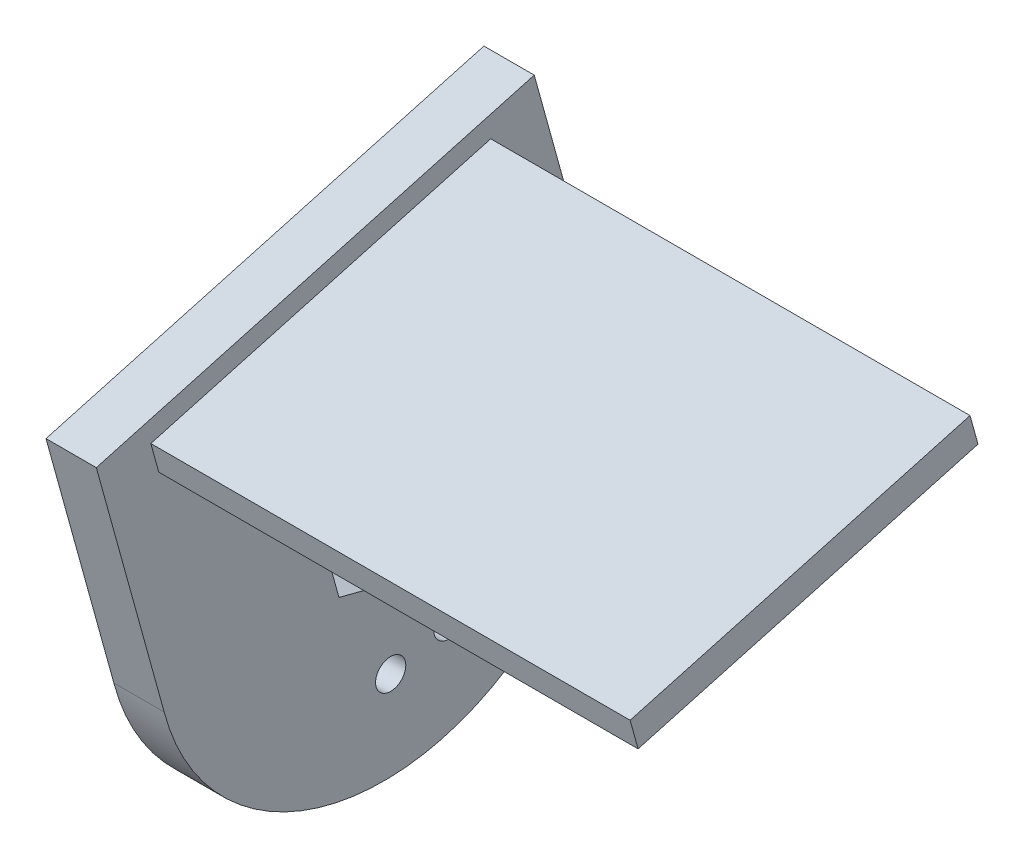
ISO-10303-21;
HEADER;
FILE_DESCRIPTION(('STEP AP214'),'2;1');
FILE_NAME('part.step','',(''),(''),'','','');
FILE_SCHEMA(('AUTOMOTIVE_DESIGN { 1 0 10303 214 1 1 1 1 }'));
ENDSEC;
DATA;
#1=APPLICATION_CONTEXT('core data for automotive mechanical design processes');
#2=APPLICATION_PROTOCOL_DEFINITION('international standard','automotive_design',2000,#1);
#3=PRODUCT_CONTEXT('',#1,'mechanical');
#4=PRODUCT('Part','Part','',(#3));
#5=PRODUCT_RELATED_PRODUCT_CATEGORY('part','',(#4));
#6=PRODUCT_DEFINITION_FORMATION('','',#4);
#7=PRODUCT_DEFINITION_CONTEXT('part definition',#1,'design');
#8=PRODUCT_DEFINITION('design','',#6,#7);
#9=PRODUCT_DEFINITION_SHAPE('','',#8);
#10=(LENGTH_UNIT() NAMED_UNIT(*) SI_UNIT(.MILLI.,.METRE.));
#11=(NAMED_UNIT(*) PLANE_ANGLE_UNIT() SI_UNIT($,.RADIAN.));
#12=(NAMED_UNIT(*) SI_UNIT($,.STERADIAN.) SOLID_ANGLE_UNIT());
#13=UNCERTAINTY_MEASURE_WITH_UNIT(LENGTH_MEASURE(1.E-05),#10,'distance_accuracy_value','');
#14=(GEOMETRIC_REPRESENTATION_CONTEXT(3) GLOBAL_UNCERTAINTY_ASSIGNED_CONTEXT((#13)) GLOBAL_UNIT_ASSIGNED_CONTEXT((#10,
#11,#12)) REPRESENTATION_CONTEXT('',''));
#15=CARTESIAN_POINT('',(0.,0.,0.));
#16=DIRECTION('',(0.,0.,1.));
#17=DIRECTION('',(1.,0.,0.));
#18=AXIS2_PLACEMENT_3D('',#15,#16,#17);
#19=CARTESIAN_POINT('',(5.,0.,0.));
#20=DIRECTION('',(1.,0.,0.));
#21=DIRECTION('',(0.,0.,-1.));
#22=AXIS2_PLACEMENT_3D('',#19,#20,#21);
#23=PLANE('',#22);
#24=CARTESIAN_POINT('',(5.,-13.6872135362353,-0.669304584604845));
#25=DIRECTION('',(1.,0.,0.));
#26=DIRECTION('',(0.,0.,-1.));
#27=AXIS2_PLACEMENT_3D('',#24,#25,#26);
#28=CIRCLE('',#27,1.5);
#29=CARTESIAN_POINT('',(5.,-13.6872135362353,-2.16930458460485));
#30=VERTEX_POINT('',#29);
#31=EDGE_CURVE('E179',#30,#30,#28,.T.);
#32=ORIENTED_EDGE('',*,*,#31,.F.);
#33=EDGE_LOOP('',(#32));
#34=FACE_BOUND('',#33,.T.);
#35=CARTESIAN_POINT('',(5.,-12.0893135533867,-6.45261813695633));
#36=DIRECTION('',(1.,0.,0.));
#37=DIRECTION('',(0.,0.,-1.));
#38=AXIS2_PLACEMENT_3D('',#35,#36,#37);
#39=CIRCLE('',#38,1.5);
#40=CARTESIAN_POINT('',(5.,-12.0893135533867,-7.95261813695633));
#41=VERTEX_POINT('',#40);
#42=EDGE_CURVE('E185',#41,#41,#39,.T.);
#43=ORIENTED_EDGE('',*,*,#42,.F.);
#44=EDGE_LOOP('',(#43));
#45=FACE_BOUND('',#44,.T.);
#46=DIRECTION('',(0.,0.25130579972035,0.967907740968588));
#47=VECTOR('',#46,1.);
#48=CARTESIAN_POINT('',(5.,-6.14217687946013,-1.69705208640331));
#49=LINE('',#48,#47);
#50=CARTESIAN_POINT('',(5.,-6.14217687946013,-1.69705208640331));
#51=VERTEX_POINT('',#50);
#52=CARTESIAN_POINT('',(5.,-4.54077865810072,4.47075516894825));
#53=VERTEX_POINT('',#52);
#54=EDGE_CURVE('E189',#51,#53,#49,.T.);
#55=ORIENTED_EDGE('',*,*,#54,.T.);
#56=DIRECTION('',(0.,0.96388559205858,0.266316663808106));
#57=VECTOR('',#56,1.);
#58=CARTESIAN_POINT('',(5.,-4.54077865810072,4.47075516894825));
#59=LINE('',#58,#57);
#60=CARTESIAN_POINT('',(5.,1.60139822135941,6.16780725535156));
#61=VERTEX_POINT('',#60);
#62=EDGE_CURVE('E192',#53,#61,#59,.T.);
#63=ORIENTED_EDGE('',*,*,#62,.T.);
#64=DIRECTION('',(0.,0.71257979233823,-0.701591077160482));
#65=VECTOR('',#64,1.);
#66=CARTESIAN_POINT('',(5.,1.60139822135941,6.16780725535156));
#67=LINE('',#66,#65);
#68=CARTESIAN_POINT('',(5.,6.14217687946013,1.69705208640331));
#69=VERTEX_POINT('',#68);
#70=EDGE_CURVE('E58',#61,#69,#67,.T.);
#71=ORIENTED_EDGE('',*,*,#70,.T.);
#72=DIRECTION('',(0.,-0.25130579972035,-0.967907740968588));
#73=VECTOR('',#72,1.);
#74=CARTESIAN_POINT('',(5.,6.14217687946013,1.69705208640331));
#75=LINE('',#74,#73);
#76=CARTESIAN_POINT('',(5.,4.54077865810072,-4.47075516894824));
#77=VERTEX_POINT('',#76);
#78=EDGE_CURVE('E197',#69,#77,#75,.T.);
#79=ORIENTED_EDGE('',*,*,#78,.T.);
#80=DIRECTION('',(0.,-0.96388559205858,-0.266316663808106));
#81=VECTOR('',#80,1.);
#82=CARTESIAN_POINT('',(5.,4.54077865810072,-4.47075516894824));
#83=LINE('',#82,#81);
#84=CARTESIAN_POINT('',(5.,-1.60139822135941,-6.16780725535156));
#85=VERTEX_POINT('',#84);
#86=EDGE_CURVE('E200',#77,#85,#83,.T.);
#87=ORIENTED_EDGE('',*,*,#86,.T.);
#88=DIRECTION('',(0.,-0.71257979233823,0.701591077160482));
#89=VECTOR('',#88,1.);
#90=CARTESIAN_POINT('',(5.,-1.60139822135941,-6.16780725535156));
#91=LINE('',#90,#89);
#92=EDGE_CURVE('E203',#85,#51,#91,.T.);
#93=ORIENTED_EDGE('',*,*,#92,.T.);
#94=EDGE_LOOP('',(#55,#63,#71,#79,#87,#93));
#95=FACE_BOUND('',#94,.T.);
#96=CARTESIAN_POINT('',(5.,0.,0.));
#97=DIRECTION('',(1.,0.,0.));
#98=DIRECTION('',(0.,0.,-1.));
#99=AXIS2_PLACEMENT_3D('',#96,#97,#98);
#100=CIRCLE('',#99,22.57);
#101=CARTESIAN_POINT('',(5.,-5.71777134942228,21.8337351544743));
#102=VERTEX_POINT('',#101);
#103=CARTESIAN_POINT('',(5.,5.71777134942228,-21.8337351544743));
#104=VERTEX_POINT('',#103);
#105=EDGE_CURVE('E271',#102,#104,#100,.T.);
#106=ORIENTED_EDGE('',*,*,#105,.T.);
#107=CARTESIAN_POINT('',(5.,5.71777134942228,-21.8337351544743));
#108=DIRECTION('',(0.,0.963885592058581,0.266316663808105));
#109=VECTOR('',#108,1.);
#110=LINE('',#107,#109);
#111=CARTESIAN_POINT('',(5.,6.30267656327408,-21.6721288326448));
#112=VERTEX_POINT('',#111);
#113=EDGE_CURVE('E11',#104,#112,#110,.T.);
#114=ORIENTED_EDGE('',*,*,#113,.T.);
#115=DIRECTION('',(0.,0.963885592058581,0.266316663808103));
#116=VECTOR('',#115,1.);
#117=CARTESIAN_POINT('',(5.,5.71777134942199,-21.8337351544744));
#118=LINE('',#117,#116);
#119=CARTESIAN_POINT('',(5.,30.701130063025,-14.9309608022632));
#120=VERTEX_POINT('',#119);
#121=EDGE_CURVE('E224',#112,#120,#118,.T.);
#122=ORIENTED_EDGE('',*,*,#121,.T.);
#123=DIRECTION('',(0.,-0.266316663808104,0.963885592058581));
#124=VECTOR('',#123,1.);
#125=CARTESIAN_POINT('',(5.,30.701130063025,-14.9309608022632));
#126=LINE('',#125,#124);
#127=CARTESIAN_POINT('',(5.,18.6806821503286,28.5749031848559));
#128=VERTEX_POINT('',#127);
#129=EDGE_CURVE('E242',#120,#128,#126,.T.);
#130=ORIENTED_EDGE('',*,*,#129,.T.);
#131=DIRECTION('',(0.,-0.963885592058581,-0.266316663808103));
#132=VECTOR('',#131,1.);
#133=CARTESIAN_POINT('',(5.,18.6806821503286,28.5749031848559));
#134=LINE('',#133,#132);
#135=EDGE_CURVE('E245',#128,#102,#134,.T.);
#136=ORIENTED_EDGE('',*,*,#135,.T.);
#137=EDGE_LOOP('',(#106,#114,#122,#130,#136));
#138=FACE_BOUND('',#137,.T.);
#139=DIRECTION('',(0.,-0.963885592058581,-0.266316663808105));
#140=VECTOR('',#139,1.);
#141=CARTESIAN_POINT('',(5.,24.5213680005241,-11.3991864792168));
#142=LINE('',#141,#140);
#143=CARTESIAN_POINT('',(5.,27.380265447074,-10.6092877231739));
#144=VERTEX_POINT('',#143);
#145=CARTESIAN_POINT('',(5.,24.5213680005241,-11.3991864792168));
#146=VERTEX_POINT('',#145);
#147=EDGE_CURVE('E145',#144,#146,#142,.T.);
#148=ORIENTED_EDGE('',*,*,#147,.T.);
#149=DIRECTION('',(0.,-0.266316663808104,0.963885592058581));
#150=VECTOR('',#149,1.);
#151=CARTESIAN_POINT('',(5.,15.1907183922895,22.3714330281106));
#152=LINE('',#151,#150);
#153=CARTESIAN_POINT('',(5.,15.1907183922895,22.3714330281106));
#154=VERTEX_POINT('',#153);
#155=EDGE_CURVE('E174',#146,#154,#152,.T.);
#156=ORIENTED_EDGE('',*,*,#155,.T.);
#157=DIRECTION('',(0.,0.963885592058581,0.266316663808106));
#158=VECTOR('',#157,1.);
#159=CARTESIAN_POINT('',(5.,18.0496158388395,23.1613317841535));
#160=LINE('',#159,#158);
#161=CARTESIAN_POINT('',(5.,18.0496158388395,23.1613317841535));
#162=VERTEX_POINT('',#161);
#163=EDGE_CURVE('E371',#154,#162,#160,.T.);
#164=ORIENTED_EDGE('',*,*,#163,.T.);
#165=DIRECTION('',(0.,0.266316663808104,-0.963885592058581));
#166=VECTOR('',#165,1.);
#167=CARTESIAN_POINT('',(5.,27.380265447074,-10.6092877231739));
#168=LINE('',#167,#166);
#169=EDGE_CURVE('E188',#162,#144,#168,.T.);
#170=ORIENTED_EDGE('',*,*,#169,.T.);
#171=EDGE_LOOP('',(#148,#156,#164,#170));
#172=FACE_BOUND('',#171,.T.);
#173=ADVANCED_FACE('F32',(#34,#45,#95,#138,#172),#23,.T.);
#174=CARTESIAN_POINT('',(0.,0.,0.));
#175=DIRECTION('',(1.,0.,0.));
#176=DIRECTION('',(0.,0.,-1.));
#177=AXIS2_PLACEMENT_3D('',#174,#175,#176);
#178=PLANE('',#177);
#179=CARTESIAN_POINT('',(0.,-13.6872135362353,-0.669304584604845));
#180=DIRECTION('',(1.,0.,0.));
#181=DIRECTION('',(0.,0.,-1.));
#182=AXIS2_PLACEMENT_3D('',#179,#180,#181);
#183=CIRCLE('',#182,1.5);
#184=CARTESIAN_POINT('',(0.,-13.6872135362353,-2.16930458460485));
#185=VERTEX_POINT('',#184);
#186=EDGE_CURVE('E175',#185,#185,#183,.T.);
#187=ORIENTED_EDGE('',*,*,#186,.T.);
#188=EDGE_LOOP('',(#187));
#189=FACE_BOUND('',#188,.T.);
#190=CARTESIAN_POINT('',(0.,-12.0893135533867,-6.45261813695633));
#191=DIRECTION('',(1.,0.,0.));
#192=DIRECTION('',(0.,0.,-1.));
#193=AXIS2_PLACEMENT_3D('',#190,#191,#192);
#194=CIRCLE('',#193,1.5);
#195=CARTESIAN_POINT('',(0.,-12.0893135533867,-7.95261813695633));
#196=VERTEX_POINT('',#195);
#197=EDGE_CURVE('E182',#196,#196,#194,.T.);
#198=ORIENTED_EDGE('',*,*,#197,.T.);
#199=EDGE_LOOP('',(#198));
#200=FACE_BOUND('',#199,.T.);
#201=DIRECTION('',(0.,0.96388559205858,0.266316663808106));
#202=VECTOR('',#201,1.);
#203=CARTESIAN_POINT('',(0.,-4.54077865810072,4.47075516894825));
#204=LINE('',#203,#202);
#205=CARTESIAN_POINT('',(0.,-4.54077865810072,4.47075516894825));
#206=VERTEX_POINT('',#205);
#207=CARTESIAN_POINT('',(0.,1.60139822135941,6.16780725535156));
#208=VERTEX_POINT('',#207);
#209=EDGE_CURVE('E208',#206,#208,#204,.T.);
#210=ORIENTED_EDGE('',*,*,#209,.F.);
#211=DIRECTION('',(0.,0.25130579972035,0.967907740968588));
#212=VECTOR('',#211,1.);
#213=CARTESIAN_POINT('',(0.,-6.14217687946013,-1.69705208640331));
#214=LINE('',#213,#212);
#215=CARTESIAN_POINT('',(0.,-6.14217687946013,-1.69705208640331));
#216=VERTEX_POINT('',#215);
#217=EDGE_CURVE('E178',#216,#206,#214,.T.);
#218=ORIENTED_EDGE('',*,*,#217,.F.);
#219=DIRECTION('',(0.,-0.71257979233823,0.701591077160482));
#220=VECTOR('',#219,1.);
#221=CARTESIAN_POINT('',(0.,-1.60139822135941,-6.16780725535156));
#222=LINE('',#221,#220);
#223=CARTESIAN_POINT('',(0.,-1.60139822135941,-6.16780725535156));
#224=VERTEX_POINT('',#223);
#225=EDGE_CURVE('E193',#224,#216,#222,.T.);
#226=ORIENTED_EDGE('',*,*,#225,.F.);
#227=DIRECTION('',(0.,-0.96388559205858,-0.266316663808106));
#228=VECTOR('',#227,1.);
#229=CARTESIAN_POINT('',(0.,4.54077865810072,-4.47075516894824));
#230=LINE('',#229,#228);
#231=CARTESIAN_POINT('',(0.,4.54077865810072,-4.47075516894824));
#232=VERTEX_POINT('',#231);
#233=EDGE_CURVE('E217',#232,#224,#230,.T.);
#234=ORIENTED_EDGE('',*,*,#233,.F.);
#235=DIRECTION('',(0.,-0.25130579972035,-0.967907740968588));
#236=VECTOR('',#235,1.);
#237=CARTESIAN_POINT('',(0.,6.14217687946013,1.69705208640331));
#238=LINE('',#237,#236);
#239=CARTESIAN_POINT('',(0.,6.14217687946013,1.69705208640331));
#240=VERTEX_POINT('',#239);
#241=EDGE_CURVE('E214',#240,#232,#238,.T.);
#242=ORIENTED_EDGE('',*,*,#241,.F.);
#243=DIRECTION('',(0.,0.71257979233823,-0.701591077160482));
#244=VECTOR('',#243,1.);
#245=CARTESIAN_POINT('',(0.,1.60139822135941,6.16780725535156));
#246=LINE('',#245,#244);
#247=EDGE_CURVE('E211',#208,#240,#246,.T.);
#248=ORIENTED_EDGE('',*,*,#247,.F.);
#249=EDGE_LOOP('',(#210,#218,#226,#234,#242,#248));
#250=FACE_BOUND('',#249,.T.);
#251=CARTESIAN_POINT('',(0.,0.,0.));
#252=DIRECTION('',(1.,0.,0.));
#253=DIRECTION('',(0.,0.,-1.));
#254=AXIS2_PLACEMENT_3D('',#251,#252,#253);
#255=CIRCLE('',#254,22.57);
#256=CARTESIAN_POINT('',(0.,-5.71777134942174,21.8337351544744));
#257=VERTEX_POINT('',#256);
#258=CARTESIAN_POINT('',(0.,5.71777134942228,-21.8337351544743));
#259=VERTEX_POINT('',#258);
#260=EDGE_CURVE('E259',#257,#259,#255,.T.);
#261=ORIENTED_EDGE('',*,*,#260,.F.);
#262=DIRECTION('',(0.,-0.963885592058581,-0.266316663808103));
#263=VECTOR('',#262,1.);
#264=CARTESIAN_POINT('',(0.,18.6806821503286,28.5749031848559));
#265=LINE('',#264,#263);
#266=CARTESIAN_POINT('',(0.,18.6806821503286,28.5749031848559));
#267=VERTEX_POINT('',#266);
#268=EDGE_CURVE('E238',#267,#257,#265,.T.);
#269=ORIENTED_EDGE('',*,*,#268,.F.);
#270=DIRECTION('',(0.,-0.266316663808104,0.963885592058581));
#271=VECTOR('',#270,1.);
#272=CARTESIAN_POINT('',(0.,30.701130063025,-14.9309608022632));
#273=LINE('',#272,#271);
#274=CARTESIAN_POINT('',(0.,30.701130063025,-14.9309608022632));
#275=VERTEX_POINT('',#274);
#276=EDGE_CURVE('E235',#275,#267,#273,.T.);
#277=ORIENTED_EDGE('',*,*,#276,.F.);
#278=DIRECTION('',(0.,0.963885592058581,0.266316663808103));
#279=VECTOR('',#278,1.);
#280=CARTESIAN_POINT('',(0.,5.71777134942199,-21.8337351544744));
#281=LINE('',#280,#279);
#282=CARTESIAN_POINT('',(0.,6.30267656327408,-21.6721288326448));
#283=VERTEX_POINT('',#282);
#284=EDGE_CURVE('E239',#283,#275,#281,.T.);
#285=ORIENTED_EDGE('',*,*,#284,.F.);
#286=CARTESIAN_POINT('',(0.,0.,0.));
#287=DIRECTION('',(1.,0.,0.));
#288=DIRECTION('',(0.,0.253335017697044,-0.967378606755617));
#289=AXIS2_PLACEMENT_3D('',#286,#287,#288);
#290=CIRCLE('',#289,22.57);
#291=EDGE_CURVE('E43',#259,#283,#290,.T.);
#292=ORIENTED_EDGE('',*,*,#291,.F.);
#293=EDGE_LOOP('',(#261,#269,#277,#285,#292));
#294=FACE_BOUND('',#293,.T.);
#295=ADVANCED_FACE('F298',(#189,#200,#250,#294),#178,.F.);
#296=CARTESIAN_POINT('',(5.,0.,0.));
#297=DIRECTION('',(-1.,0.,0.));
#298=DIRECTION('',(0.,0.,1.));
#299=AXIS2_PLACEMENT_3D('',#296,#297,#298);
#300=CYLINDRICAL_SURFACE('',#299,22.57);
#301=ORIENTED_EDGE('',*,*,#113,.F.);
#302=ORIENTED_EDGE('',*,*,#105,.F.);
#303=DIRECTION('',(1.,0.,0.));
#304=VECTOR('',#303,1.);
#305=CARTESIAN_POINT('',(0.,-5.71777134942174,21.8337351544744));
#306=LINE('',#305,#304);
#307=EDGE_CURVE('E247',#257,#102,#306,.T.);
#308=ORIENTED_EDGE('',*,*,#307,.F.);
#309=ORIENTED_EDGE('',*,*,#260,.T.);
#310=ORIENTED_EDGE('',*,*,#291,.T.);
#311=DIRECTION('',(-1.,0.,0.));
#312=VECTOR('',#311,1.);
#313=CARTESIAN_POINT('',(5.,6.30267656327409,-21.6721288326448));
#314=LINE('',#313,#312);
#315=EDGE_CURVE('E250',#283,#112,#314,.F.);
#316=ORIENTED_EDGE('',*,*,#315,.T.);
#317=EDGE_LOOP('',(#301,#302,#308,#309,#310,#316));
#318=FACE_BOUND('',#317,.T.);
#319=ADVANCED_FACE('F34',(#318),#300,.T.);
#320=CARTESIAN_POINT('',(0.,5.71777134942199,-21.8337351544744));
#321=DIRECTION('',(0.,0.266316663808103,-0.963885592058581));
#322=DIRECTION('',(0.,0.963885592058581,0.266316663808103));
#323=AXIS2_PLACEMENT_3D('',#320,#321,#322);
#324=PLANE('',#323);
#325=ORIENTED_EDGE('',*,*,#315,.F.);
#326=ORIENTED_EDGE('',*,*,#284,.T.);
#327=DIRECTION('',(1.,0.,0.));
#328=VECTOR('',#327,1.);
#329=CARTESIAN_POINT('',(0.,30.701130063025,-14.9309608022632));
#330=LINE('',#329,#328);
#331=EDGE_CURVE('E241',#275,#120,#330,.T.);
#332=ORIENTED_EDGE('',*,*,#331,.T.);
#333=ORIENTED_EDGE('',*,*,#121,.F.);
#334=EDGE_LOOP('',(#325,#326,#332,#333));
#335=FACE_BOUND('',#334,.T.);
#336=ADVANCED_FACE('F311',(#335),#324,.T.);
#337=CARTESIAN_POINT('',(0.,18.6806821503286,28.5749031848559));
#338=DIRECTION('',(0.,-0.266316663808103,0.963885592058581));
#339=DIRECTION('',(0.,-0.963885592058581,-0.266316663808103));
#340=AXIS2_PLACEMENT_3D('',#337,#338,#339);
#341=PLANE('',#340);
#342=ORIENTED_EDGE('',*,*,#135,.F.);
#343=DIRECTION('',(1.,0.,0.));
#344=VECTOR('',#343,1.);
#345=CARTESIAN_POINT('',(0.,18.6806821503286,28.5749031848559));
#346=LINE('',#345,#344);
#347=EDGE_CURVE('E251',#267,#128,#346,.T.);
#348=ORIENTED_EDGE('',*,*,#347,.F.);
#349=ORIENTED_EDGE('',*,*,#268,.T.);
#350=ORIENTED_EDGE('',*,*,#307,.T.);
#351=EDGE_LOOP('',(#342,#348,#349,#350));
#352=FACE_BOUND('',#351,.T.);
#353=ADVANCED_FACE('F314',(#352),#341,.T.);
#354=CARTESIAN_POINT('',(0.,30.701130063025,-14.9309608022632));
#355=DIRECTION('',(0.,0.963885592058581,0.266316663808104));
#356=DIRECTION('',(0.,-0.266316663808104,0.963885592058581));
#357=AXIS2_PLACEMENT_3D('',#354,#355,#356);
#358=PLANE('',#357);
#359=ORIENTED_EDGE('',*,*,#129,.F.);
#360=ORIENTED_EDGE('',*,*,#331,.F.);
#361=ORIENTED_EDGE('',*,*,#276,.T.);
#362=ORIENTED_EDGE('',*,*,#347,.T.);
#363=EDGE_LOOP('',(#359,#360,#361,#362));
#364=FACE_BOUND('',#363,.T.);
#365=ADVANCED_FACE('F316',(#364),#358,.T.);
#366=CARTESIAN_POINT('',(5.,-6.14217687946013,-1.69705208640331));
#367=DIRECTION('',(0.,-0.967907740968588,0.25130579972035));
#368=DIRECTION('',(0.,-0.25130579972035,-0.967907740968588));
#369=AXIS2_PLACEMENT_3D('',#366,#367,#368);
#370=PLANE('',#369);
#371=ORIENTED_EDGE('',*,*,#217,.T.);
#372=DIRECTION('',(-1.,0.,0.));
#373=VECTOR('',#372,1.);
#374=CARTESIAN_POINT('',(5.,-4.54077865810072,4.47075516894825));
#375=LINE('',#374,#373);
#376=EDGE_CURVE('E206',#53,#206,#375,.T.);
#377=ORIENTED_EDGE('',*,*,#376,.F.);
#378=ORIENTED_EDGE('',*,*,#54,.F.);
#379=DIRECTION('',(-1.,0.,0.));
#380=VECTOR('',#379,1.);
#381=CARTESIAN_POINT('',(5.,-6.14217687946013,-1.69705208640331));
#382=LINE('',#381,#380);
#383=EDGE_CURVE('E222',#51,#216,#382,.T.);
#384=ORIENTED_EDGE('',*,*,#383,.T.);
#385=EDGE_LOOP('',(#371,#377,#378,#384));
#386=FACE_BOUND('',#385,.T.);
#387=ADVANCED_FACE('F319',(#386),#370,.F.);
#388=CARTESIAN_POINT('',(5.,-1.60139822135941,-6.16780725535156));
#389=DIRECTION('',(0.,-0.701591077160482,-0.71257979233823));
#390=DIRECTION('',(0.,0.71257979233823,-0.701591077160482));
#391=AXIS2_PLACEMENT_3D('',#388,#389,#390);
#392=PLANE('',#391);
#393=ORIENTED_EDGE('',*,*,#225,.T.);
#394=ORIENTED_EDGE('',*,*,#383,.F.);
#395=ORIENTED_EDGE('',*,*,#92,.F.);
#396=DIRECTION('',(-1.,0.,0.));
#397=VECTOR('',#396,1.);
#398=CARTESIAN_POINT('',(5.,-1.60139822135941,-6.16780725535156));
#399=LINE('',#398,#397);
#400=EDGE_CURVE('E225',#85,#224,#399,.T.);
#401=ORIENTED_EDGE('',*,*,#400,.T.);
#402=EDGE_LOOP('',(#393,#394,#395,#401));
#403=FACE_BOUND('',#402,.T.);
#404=ADVANCED_FACE('F326',(#403),#392,.F.);
#405=CARTESIAN_POINT('',(5.,4.54077865810072,-4.47075516894824));
#406=DIRECTION('',(0.,0.266316663808106,-0.96388559205858));
#407=DIRECTION('',(0.,0.963885592058581,0.266316663808106));
#408=AXIS2_PLACEMENT_3D('',#405,#406,#407);
#409=PLANE('',#408);
#410=ORIENTED_EDGE('',*,*,#233,.T.);
#411=ORIENTED_EDGE('',*,*,#400,.F.);
#412=ORIENTED_EDGE('',*,*,#86,.F.);
#413=DIRECTION('',(-1.,0.,0.));
#414=VECTOR('',#413,1.);
#415=CARTESIAN_POINT('',(5.,4.54077865810072,-4.47075516894824));
#416=LINE('',#415,#414);
#417=EDGE_CURVE('E227',#77,#232,#416,.T.);
#418=ORIENTED_EDGE('',*,*,#417,.T.);
#419=EDGE_LOOP('',(#410,#411,#412,#418));
#420=FACE_BOUND('',#419,.T.);
#421=ADVANCED_FACE('F339',(#420),#409,.F.);
#422=CARTESIAN_POINT('',(5.,6.14217687946013,1.69705208640331));
#423=DIRECTION('',(0.,0.967907740968588,-0.25130579972035));
#424=DIRECTION('',(0.,0.25130579972035,0.967907740968588));
#425=AXIS2_PLACEMENT_3D('',#422,#423,#424);
#426=PLANE('',#425);
#427=ORIENTED_EDGE('',*,*,#241,.T.);
#428=ORIENTED_EDGE('',*,*,#417,.F.);
#429=ORIENTED_EDGE('',*,*,#78,.F.);
#430=DIRECTION('',(-1.,0.,0.));
#431=VECTOR('',#430,1.);
#432=CARTESIAN_POINT('',(5.,6.14217687946013,1.69705208640331));
#433=LINE('',#432,#431);
#434=EDGE_CURVE('E229',#69,#240,#433,.T.);
#435=ORIENTED_EDGE('',*,*,#434,.T.);
#436=EDGE_LOOP('',(#427,#428,#429,#435));
#437=FACE_BOUND('',#436,.T.);
#438=ADVANCED_FACE('F336',(#437),#426,.F.);
#439=CARTESIAN_POINT('',(5.,1.60139822135941,6.16780725535156));
#440=DIRECTION('',(0.,0.701591077160482,0.71257979233823));
#441=DIRECTION('',(0.,-0.71257979233823,0.701591077160482));
#442=AXIS2_PLACEMENT_3D('',#439,#440,#441);
#443=PLANE('',#442);
#444=ORIENTED_EDGE('',*,*,#247,.T.);
#445=ORIENTED_EDGE('',*,*,#434,.F.);
#446=ORIENTED_EDGE('',*,*,#70,.F.);
#447=DIRECTION('',(-1.,0.,0.));
#448=VECTOR('',#447,1.);
#449=CARTESIAN_POINT('',(5.,1.60139822135941,6.16780725535156));
#450=LINE('',#449,#448);
#451=EDGE_CURVE('E231',#61,#208,#450,.T.);
#452=ORIENTED_EDGE('',*,*,#451,.T.);
#453=EDGE_LOOP('',(#444,#445,#446,#452));
#454=FACE_BOUND('',#453,.T.);
#455=ADVANCED_FACE('F332',(#454),#443,.F.);
#456=CARTESIAN_POINT('',(5.,-4.54077865810072,4.47075516894825));
#457=DIRECTION('',(0.,-0.266316663808106,0.963885592058581));
#458=DIRECTION('',(0.,-0.963885592058581,-0.266316663808106));
#459=AXIS2_PLACEMENT_3D('',#456,#457,#458);
#460=PLANE('',#459);
#461=ORIENTED_EDGE('',*,*,#209,.T.);
#462=ORIENTED_EDGE('',*,*,#451,.F.);
#463=ORIENTED_EDGE('',*,*,#62,.F.);
#464=ORIENTED_EDGE('',*,*,#376,.T.);
#465=EDGE_LOOP('',(#461,#462,#463,#464));
#466=FACE_BOUND('',#465,.T.);
#467=ADVANCED_FACE('F328',(#466),#460,.F.);
#468=CARTESIAN_POINT('',(0.,-12.0893135533867,-6.45261813695633));
#469=DIRECTION('',(1.,0.,0.));
#470=DIRECTION('',(0.,0.,-1.));
#471=AXIS2_PLACEMENT_3D('',#468,#469,#470);
#472=CYLINDRICAL_SURFACE('',#471,1.5);
#473=ORIENTED_EDGE('',*,*,#197,.F.);
#474=EDGE_LOOP('',(#473));
#475=FACE_BOUND('',#474,.T.);
#476=ORIENTED_EDGE('',*,*,#42,.T.);
#477=EDGE_LOOP('',(#476));
#478=FACE_BOUND('',#477,.T.);
#479=ADVANCED_FACE('F331',(#475,#478),#472,.F.);
#480=CARTESIAN_POINT('',(0.,-13.6872135362353,-0.669304584604845));
#481=DIRECTION('',(1.,0.,0.));
#482=DIRECTION('',(0.,0.,-1.));
#483=AXIS2_PLACEMENT_3D('',#480,#481,#482);
#484=CYLINDRICAL_SURFACE('',#483,1.5);
#485=ORIENTED_EDGE('',*,*,#186,.F.);
#486=EDGE_LOOP('',(#485));
#487=FACE_BOUND('',#486,.T.);
#488=ORIENTED_EDGE('',*,*,#31,.T.);
#489=EDGE_LOOP('',(#488));
#490=FACE_BOUND('',#489,.T.);
#491=ADVANCED_FACE('F349',(#487,#490),#484,.F.);
#492=CARTESIAN_POINT('',(-31.8041730670399,24.5213680005241,-11.3991864792168));
#493=DIRECTION('',(0.,0.266316663808105,-0.963885592058581));
#494=DIRECTION('',(0.,0.963885592058581,0.266316663808105));
#495=AXIS2_PLACEMENT_3D('',#492,#493,#494);
#496=PLANE('',#495);
#497=DIRECTION('',(1.,0.,0.));
#498=VECTOR('',#497,1.);
#499=CARTESIAN_POINT('',(-31.8041730670399,27.380265447074,-10.6092877231739));
#500=LINE('',#499,#498);
#501=CARTESIAN_POINT('',(52.62,27.380265447074,-10.6092877231739));
#502=VERTEX_POINT('',#501);
#503=EDGE_CURVE('E141',#144,#502,#500,.T.);
#504=ORIENTED_EDGE('',*,*,#503,.T.);
#505=DIRECTION('',(0.,0.963885592058581,0.266316663808105));
#506=VECTOR('',#505,1.);
#507=CARTESIAN_POINT('',(52.62,24.5213680005241,-11.3991864792168));
#508=LINE('',#507,#506);
#509=CARTESIAN_POINT('',(52.62,24.5213680005241,-11.3991864792168));
#510=VERTEX_POINT('',#509);
#511=EDGE_CURVE('E50',#510,#502,#508,.T.);
#512=ORIENTED_EDGE('',*,*,#511,.F.);
#513=DIRECTION('',(1.,0.,0.));
#514=VECTOR('',#513,1.);
#515=CARTESIAN_POINT('',(-31.8041730670399,24.5213680005241,-11.3991864792168));
#516=LINE('',#515,#514);
#517=EDGE_CURVE('E149',#146,#510,#516,.T.);
#518=ORIENTED_EDGE('',*,*,#517,.F.);
#519=ORIENTED_EDGE('',*,*,#147,.F.);
#520=EDGE_LOOP('',(#504,#512,#518,#519));
#521=FACE_BOUND('',#520,.T.);
#522=ADVANCED_FACE('F143',(#521),#496,.T.);
#523=CARTESIAN_POINT('',(-31.8041730670399,27.380265447074,-10.6092877231739));
#524=DIRECTION('',(0.,0.963885592058581,0.266316663808104));
#525=DIRECTION('',(0.,-0.266316663808104,0.963885592058581));
#526=AXIS2_PLACEMENT_3D('',#523,#524,#525);
#527=PLANE('',#526);
#528=DIRECTION('',(1.,0.,0.));
#529=VECTOR('',#528,1.);
#530=CARTESIAN_POINT('',(-31.8041730670399,18.0496158388395,23.1613317841535));
#531=LINE('',#530,#529);
#532=CARTESIAN_POINT('',(52.62,18.0496158388395,23.1613317841535));
#533=VERTEX_POINT('',#532);
#534=EDGE_CURVE('E148',#162,#533,#531,.T.);
#535=ORIENTED_EDGE('',*,*,#534,.T.);
#536=DIRECTION('',(0.,-0.266316663808104,0.963885592058581));
#537=VECTOR('',#536,1.);
#538=CARTESIAN_POINT('',(52.62,27.380265447074,-10.6092877231739));
#539=LINE('',#538,#537);
#540=EDGE_CURVE('E152',#502,#533,#539,.T.);
#541=ORIENTED_EDGE('',*,*,#540,.F.);
#542=ORIENTED_EDGE('',*,*,#503,.F.);
#543=ORIENTED_EDGE('',*,*,#169,.F.);
#544=EDGE_LOOP('',(#535,#541,#542,#543));
#545=FACE_BOUND('',#544,.T.);
#546=ADVANCED_FACE('F153',(#545),#527,.T.);
#547=CARTESIAN_POINT('',(-31.8041730670399,18.0496158388395,23.1613317841535));
#548=DIRECTION('',(0.,-0.266316663808106,0.96388559205858));
#549=DIRECTION('',(0.,-0.963885592058581,-0.266316663808106));
#550=AXIS2_PLACEMENT_3D('',#547,#548,#549);
#551=PLANE('',#550);
#552=DIRECTION('',(1.,0.,0.));
#553=VECTOR('',#552,1.);
#554=CARTESIAN_POINT('',(-31.8041730670399,15.1907183922895,22.3714330281106));
#555=LINE('',#554,#553);
#556=CARTESIAN_POINT('',(52.62,15.1907183922895,22.3714330281106));
#557=VERTEX_POINT('',#556);
#558=EDGE_CURVE('E169',#154,#557,#555,.T.);
#559=ORIENTED_EDGE('',*,*,#558,.T.);
#560=DIRECTION('',(0.,-0.96388559205858,-0.266316663808106));
#561=VECTOR('',#560,1.);
#562=CARTESIAN_POINT('',(52.62,18.0496158388395,23.1613317841535));
#563=LINE('',#562,#561);
#564=EDGE_CURVE('E158',#533,#557,#563,.T.);
#565=ORIENTED_EDGE('',*,*,#564,.F.);
#566=ORIENTED_EDGE('',*,*,#534,.F.);
#567=ORIENTED_EDGE('',*,*,#163,.F.);
#568=EDGE_LOOP('',(#559,#565,#566,#567));
#569=FACE_BOUND('',#568,.T.);
#570=ADVANCED_FACE('F359',(#569),#551,.T.);
#571=CARTESIAN_POINT('',(-31.8041730670399,15.1907183922895,22.3714330281106));
#572=DIRECTION('',(0.,-0.963885592058581,-0.266316663808104));
#573=DIRECTION('',(0.,0.266316663808104,-0.963885592058581));
#574=AXIS2_PLACEMENT_3D('',#571,#572,#573);
#575=PLANE('',#574);
#576=ORIENTED_EDGE('',*,*,#517,.T.);
#577=DIRECTION('',(0.,0.266316663808104,-0.963885592058581));
#578=VECTOR('',#577,1.);
#579=CARTESIAN_POINT('',(52.62,15.1907183922895,22.3714330281106));
#580=LINE('',#579,#578);
#581=EDGE_CURVE('E163',#557,#510,#580,.T.);
#582=ORIENTED_EDGE('',*,*,#581,.F.);
#583=ORIENTED_EDGE('',*,*,#558,.F.);
#584=ORIENTED_EDGE('',*,*,#155,.F.);
#585=EDGE_LOOP('',(#576,#582,#583,#584));
#586=FACE_BOUND('',#585,.T.);
#587=ADVANCED_FACE('F356',(#586),#575,.T.);
#588=CARTESIAN_POINT('',(52.62,0.,0.));
#589=DIRECTION('',(-1.,0.,0.));
#590=DIRECTION('',(0.,0.266316663808104,-0.963885592058581));
#591=AXIS2_PLACEMENT_3D('',#588,#589,#590);
#592=PLANE('',#591);
#593=ORIENTED_EDGE('',*,*,#511,.T.);
#594=ORIENTED_EDGE('',*,*,#540,.T.);
#595=ORIENTED_EDGE('',*,*,#564,.T.);
#596=ORIENTED_EDGE('',*,*,#581,.T.);
#597=EDGE_LOOP('',(#593,#594,#595,#596));
#598=FACE_BOUND('',#597,.T.);
#599=ADVANCED_FACE('F161',(#598),#592,.F.);
#600=CLOSED_SHELL('',(#173,#295,#319,#336,#353,#365,#387,#404,#421,#438,#455,#467,#479,#491,
#522,#546,#570,#587,#599));
#601=MANIFOLD_SOLID_BREP('B2',#600);
#602=ADVANCED_BREP_SHAPE_REPRESENTATION('',(#18,#601),#14);
#603=SHAPE_DEFINITION_REPRESENTATION(#9,#602);
ENDSEC;
END-ISO-10303-21;
